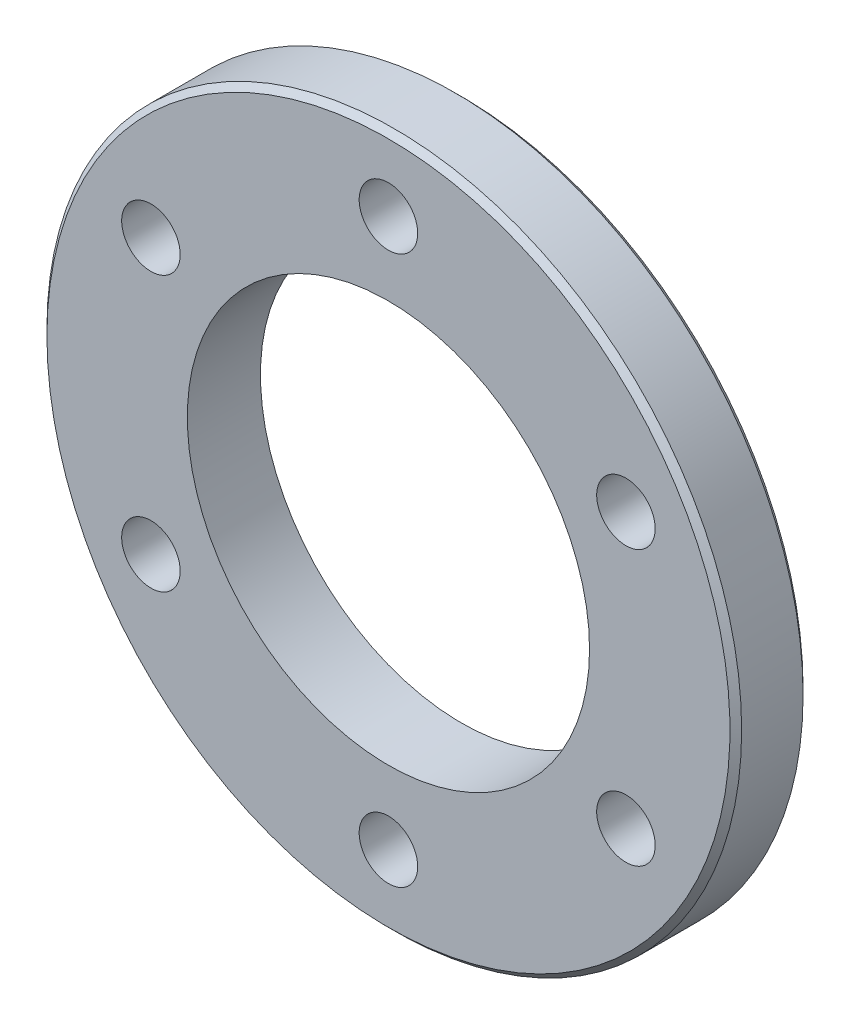
ISO-10303-21;
HEADER;
FILE_DESCRIPTION(('STEP AP214'),'2;1');
FILE_NAME('part.step','',(''),(''),'','','');
FILE_SCHEMA(('AUTOMOTIVE_DESIGN { 1 0 10303 214 1 1 1 1 }'));
ENDSEC;
DATA;
#1=APPLICATION_CONTEXT('core data for automotive mechanical design processes');
#2=APPLICATION_PROTOCOL_DEFINITION('international standard','automotive_design',2000,#1);
#3=PRODUCT_CONTEXT('',#1,'mechanical');
#4=PRODUCT('Part','Part','',(#3));
#5=PRODUCT_RELATED_PRODUCT_CATEGORY('part','',(#4));
#6=PRODUCT_DEFINITION_FORMATION('','',#4);
#7=PRODUCT_DEFINITION_CONTEXT('part definition',#1,'design');
#8=PRODUCT_DEFINITION('design','',#6,#7);
#9=PRODUCT_DEFINITION_SHAPE('','',#8);
#10=(LENGTH_UNIT() NAMED_UNIT(*) SI_UNIT(.MILLI.,.METRE.));
#11=(NAMED_UNIT(*) PLANE_ANGLE_UNIT() SI_UNIT($,.RADIAN.));
#12=(NAMED_UNIT(*) SI_UNIT($,.STERADIAN.) SOLID_ANGLE_UNIT());
#13=UNCERTAINTY_MEASURE_WITH_UNIT(LENGTH_MEASURE(1.E-05),#10,'distance_accuracy_value','');
#14=(GEOMETRIC_REPRESENTATION_CONTEXT(3) GLOBAL_UNCERTAINTY_ASSIGNED_CONTEXT((#13)) GLOBAL_UNIT_ASSIGNED_CONTEXT((#10,
#11,#12)) REPRESENTATION_CONTEXT('',''));
#15=CARTESIAN_POINT('',(0.,0.,0.));
#16=DIRECTION('',(0.,0.,1.));
#17=DIRECTION('',(1.,0.,0.));
#18=AXIS2_PLACEMENT_3D('',#15,#16,#17);
#19=CARTESIAN_POINT('',(0.,0.,5.84199999977205));
#20=DIRECTION('',(0.,0.,-1.));
#21=DIRECTION('',(-1.,0.,0.));
#22=AXIS2_PLACEMENT_3D('',#19,#20,#21);
#23=CONICAL_SURFACE('',#22,30.1624999997721,0.785398162500003);
#24=CARTESIAN_POINT('',(0.,0.,5.842));
#25=DIRECTION('',(0.,0.,1.));
#26=DIRECTION('',(1.,0.,0.));
#27=AXIS2_PLACEMENT_3D('',#24,#25,#26);
#28=CIRCLE('',#27,30.1625);
#29=CARTESIAN_POINT('',(30.1625,0.,5.842));
#30=VERTEX_POINT('',#29);
#31=EDGE_CURVE('E77',#30,#30,#28,.F.);
#32=ORIENTED_EDGE('',*,*,#31,.F.);
#33=EDGE_LOOP('',(#32));
#34=FACE_BOUND('',#33,.T.);
#35=CARTESIAN_POINT('',(0.,0.,6.35000000022795));
#36=DIRECTION('',(0.,0.,-1.));
#37=DIRECTION('',(-1.,0.,0.));
#38=AXIS2_PLACEMENT_3D('',#35,#36,#37);
#39=CIRCLE('',#38,29.654500000228);
#40=CARTESIAN_POINT('',(-29.654500000228,0.,6.35000000022795));
#41=VERTEX_POINT('',#40);
#42=EDGE_CURVE('E18',#41,#41,#39,.T.);
#43=ORIENTED_EDGE('',*,*,#42,.T.);
#44=EDGE_LOOP('',(#43));
#45=FACE_BOUND('',#44,.T.);
#46=ADVANCED_FACE('F15',(#34,#45),#23,.T.);
#47=CARTESIAN_POINT('',(0.,0.,0.));
#48=DIRECTION('',(0.,0.,1.));
#49=DIRECTION('',(1.,0.,0.));
#50=AXIS2_PLACEMENT_3D('',#47,#48,#49);
#51=CYLINDRICAL_SURFACE('',#50,30.1625);
#52=CARTESIAN_POINT('',(0.,0.,0.508000000227951));
#53=DIRECTION('',(0.,0.,1.));
#54=DIRECTION('',(-1.,0.,0.));
#55=AXIS2_PLACEMENT_3D('',#52,#53,#54);
#56=CIRCLE('',#55,30.1624999997721);
#57=CARTESIAN_POINT('',(-30.162499999772,0.,0.508000000227952));
#58=VERTEX_POINT('',#57);
#59=EDGE_CURVE('E69',#58,#58,#56,.F.);
#60=ORIENTED_EDGE('',*,*,#59,.F.);
#61=EDGE_LOOP('',(#60));
#62=FACE_BOUND('',#61,.T.);
#63=ORIENTED_EDGE('',*,*,#31,.T.);
#64=EDGE_LOOP('',(#63));
#65=FACE_BOUND('',#64,.T.);
#66=ADVANCED_FACE('F83',(#62,#65),#51,.T.);
#67=CARTESIAN_POINT('',(0.,0.,6.35));
#68=DIRECTION('',(0.,0.,-1.));
#69=DIRECTION('',(-1.,0.,0.));
#70=AXIS2_PLACEMENT_3D('',#67,#68,#69);
#71=PLANE('',#70);
#72=CARTESIAN_POINT('',(0.,0.,6.35));
#73=DIRECTION('',(0.,0.,1.));
#74=DIRECTION('',(1.,0.,0.));
#75=AXIS2_PLACEMENT_3D('',#72,#73,#74);
#76=CIRCLE('',#75,17.4625);
#77=CARTESIAN_POINT('',(17.4625,0.,6.35));
#78=VERTEX_POINT('',#77);
#79=EDGE_CURVE('E50',#78,#78,#76,.F.);
#80=ORIENTED_EDGE('',*,*,#79,.T.);
#81=EDGE_LOOP('',(#80));
#82=FACE_BOUND('',#81,.T.);
#83=CARTESIAN_POINT('',(20.622229927617,11.90625,6.35));
#84=DIRECTION('',(0.,0.,1.));
#85=DIRECTION('',(1.,0.,0.));
#86=AXIS2_PLACEMENT_3D('',#83,#84,#85);
#87=CIRCLE('',#86,2.54);
#88=CARTESIAN_POINT('',(23.162229927617,11.90625,6.35));
#89=VERTEX_POINT('',#88);
#90=EDGE_CURVE('E53',#89,#89,#87,.F.);
#91=ORIENTED_EDGE('',*,*,#90,.T.);
#92=EDGE_LOOP('',(#91));
#93=FACE_BOUND('',#92,.T.);
#94=CARTESIAN_POINT('',(20.6222299276169,-11.90625,6.35));
#95=DIRECTION('',(0.,0.,1.));
#96=DIRECTION('',(1.,0.,0.));
#97=AXIS2_PLACEMENT_3D('',#94,#95,#96);
#98=CIRCLE('',#97,2.54);
#99=CARTESIAN_POINT('',(23.1622299276169,-11.90625,6.35));
#100=VERTEX_POINT('',#99);
#101=EDGE_CURVE('E56',#100,#100,#98,.F.);
#102=ORIENTED_EDGE('',*,*,#101,.T.);
#103=EDGE_LOOP('',(#102));
#104=FACE_BOUND('',#103,.T.);
#105=CARTESIAN_POINT('',(0.,-23.8125,6.35));
#106=DIRECTION('',(0.,0.,1.));
#107=DIRECTION('',(1.,0.,0.));
#108=AXIS2_PLACEMENT_3D('',#105,#106,#107);
#109=CIRCLE('',#108,2.54);
#110=CARTESIAN_POINT('',(2.54,-23.8125,6.35));
#111=VERTEX_POINT('',#110);
#112=EDGE_CURVE('E59',#111,#111,#109,.F.);
#113=ORIENTED_EDGE('',*,*,#112,.T.);
#114=EDGE_LOOP('',(#113));
#115=FACE_BOUND('',#114,.T.);
#116=CARTESIAN_POINT('',(-20.6222299276169,-11.90625,6.35));
#117=DIRECTION('',(0.,0.,1.));
#118=DIRECTION('',(1.,0.,0.));
#119=AXIS2_PLACEMENT_3D('',#116,#117,#118);
#120=CIRCLE('',#119,2.54);
#121=CARTESIAN_POINT('',(-18.0822299276169,-11.90625,6.35));
#122=VERTEX_POINT('',#121);
#123=EDGE_CURVE('E62',#122,#122,#120,.F.);
#124=ORIENTED_EDGE('',*,*,#123,.T.);
#125=EDGE_LOOP('',(#124));
#126=FACE_BOUND('',#125,.T.);
#127=CARTESIAN_POINT('',(-20.6222299276169,11.90625,6.35));
#128=DIRECTION('',(0.,0.,1.));
#129=DIRECTION('',(1.,0.,0.));
#130=AXIS2_PLACEMENT_3D('',#127,#128,#129);
#131=CIRCLE('',#130,2.54);
#132=CARTESIAN_POINT('',(-18.0822299276169,11.90625,6.35));
#133=VERTEX_POINT('',#132);
#134=EDGE_CURVE('E65',#133,#133,#131,.F.);
#135=ORIENTED_EDGE('',*,*,#134,.T.);
#136=EDGE_LOOP('',(#135));
#137=FACE_BOUND('',#136,.T.);
#138=CARTESIAN_POINT('',(0.,23.8125,6.35));
#139=DIRECTION('',(0.,0.,1.));
#140=DIRECTION('',(1.,0.,0.));
#141=AXIS2_PLACEMENT_3D('',#138,#139,#140);
#142=CIRCLE('',#141,2.54);
#143=CARTESIAN_POINT('',(2.54,23.8125,6.35));
#144=VERTEX_POINT('',#143);
#145=EDGE_CURVE('E67',#144,#144,#142,.F.);
#146=ORIENTED_EDGE('',*,*,#145,.T.);
#147=EDGE_LOOP('',(#146));
#148=FACE_BOUND('',#147,.T.);
#149=ORIENTED_EDGE('',*,*,#42,.F.);
#150=EDGE_LOOP('',(#149));
#151=FACE_BOUND('',#150,.T.);
#152=ADVANCED_FACE('F89',(#82,#93,#104,#115,#126,#137,#148,#151),#71,.F.);
#153=CARTESIAN_POINT('',(0.,0.,0.508000000227954));
#154=DIRECTION('',(0.,0.,1.));
#155=DIRECTION('',(1.,0.,0.));
#156=AXIS2_PLACEMENT_3D('',#153,#154,#155);
#157=CONICAL_SURFACE('',#156,30.1624999997721,0.785398162500002);
#158=CARTESIAN_POINT('',(0.,0.,-2.27951121520298E-10));
#159=DIRECTION('',(0.,0.,1.));
#160=DIRECTION('',(1.,0.,0.));
#161=AXIS2_PLACEMENT_3D('',#158,#159,#160);
#162=CIRCLE('',#161,29.654500000228);
#163=CARTESIAN_POINT('',(29.654500000228,0.,-2.27951121520298E-10));
#164=VERTEX_POINT('',#163);
#165=EDGE_CURVE('E47',#164,#164,#162,.F.);
#166=ORIENTED_EDGE('',*,*,#165,.F.);
#167=EDGE_LOOP('',(#166));
#168=FACE_BOUND('',#167,.T.);
#169=ORIENTED_EDGE('',*,*,#59,.T.);
#170=EDGE_LOOP('',(#169));
#171=FACE_BOUND('',#170,.T.);
#172=ADVANCED_FACE('F91',(#168,#171),#157,.T.);
#173=CARTESIAN_POINT('',(0.,23.8125,0.));
#174=DIRECTION('',(0.,0.,1.));
#175=DIRECTION('',(1.,0.,0.));
#176=AXIS2_PLACEMENT_3D('',#173,#174,#175);
#177=CYLINDRICAL_SURFACE('',#176,2.54);
#178=CARTESIAN_POINT('',(0.,23.8125,0.));
#179=DIRECTION('',(0.,0.,1.));
#180=DIRECTION('',(1.,0.,0.));
#181=AXIS2_PLACEMENT_3D('',#178,#179,#180);
#182=CIRCLE('',#181,2.54);
#183=CARTESIAN_POINT('',(2.54,23.8125,0.));
#184=VERTEX_POINT('',#183);
#185=EDGE_CURVE('E44',#184,#184,#182,.T.);
#186=ORIENTED_EDGE('',*,*,#185,.F.);
#187=EDGE_LOOP('',(#186));
#188=FACE_BOUND('',#187,.T.);
#189=ORIENTED_EDGE('',*,*,#145,.F.);
#190=EDGE_LOOP('',(#189));
#191=FACE_BOUND('',#190,.T.);
#192=ADVANCED_FACE('F99',(#188,#191),#177,.F.);
#193=CARTESIAN_POINT('',(-20.6222299276169,11.90625,0.));
#194=DIRECTION('',(0.,0.,1.));
#195=DIRECTION('',(1.,0.,0.));
#196=AXIS2_PLACEMENT_3D('',#193,#194,#195);
#197=CYLINDRICAL_SURFACE('',#196,2.54);
#198=CARTESIAN_POINT('',(-20.6222299276169,11.90625,0.));
#199=DIRECTION('',(0.,0.,1.));
#200=DIRECTION('',(1.,0.,0.));
#201=AXIS2_PLACEMENT_3D('',#198,#199,#200);
#202=CIRCLE('',#201,2.54);
#203=CARTESIAN_POINT('',(-18.0822299276169,11.90625,0.));
#204=VERTEX_POINT('',#203);
#205=EDGE_CURVE('E41',#204,#204,#202,.T.);
#206=ORIENTED_EDGE('',*,*,#205,.F.);
#207=EDGE_LOOP('',(#206));
#208=FACE_BOUND('',#207,.T.);
#209=ORIENTED_EDGE('',*,*,#134,.F.);
#210=EDGE_LOOP('',(#209));
#211=FACE_BOUND('',#210,.T.);
#212=ADVANCED_FACE('F130',(#208,#211),#197,.F.);
#213=CARTESIAN_POINT('',(-20.6222299276169,-11.90625,0.));
#214=DIRECTION('',(0.,0.,1.));
#215=DIRECTION('',(1.,0.,0.));
#216=AXIS2_PLACEMENT_3D('',#213,#214,#215);
#217=CYLINDRICAL_SURFACE('',#216,2.54);
#218=CARTESIAN_POINT('',(-20.6222299276169,-11.90625,0.));
#219=DIRECTION('',(0.,0.,1.));
#220=DIRECTION('',(1.,0.,0.));
#221=AXIS2_PLACEMENT_3D('',#218,#219,#220);
#222=CIRCLE('',#221,2.54);
#223=CARTESIAN_POINT('',(-18.0822299276169,-11.90625,0.));
#224=VERTEX_POINT('',#223);
#225=EDGE_CURVE('E38',#224,#224,#222,.T.);
#226=ORIENTED_EDGE('',*,*,#225,.F.);
#227=EDGE_LOOP('',(#226));
#228=FACE_BOUND('',#227,.T.);
#229=ORIENTED_EDGE('',*,*,#123,.F.);
#230=EDGE_LOOP('',(#229));
#231=FACE_BOUND('',#230,.T.);
#232=ADVANCED_FACE('F126',(#228,#231),#217,.F.);
#233=CARTESIAN_POINT('',(0.,-23.8125,0.));
#234=DIRECTION('',(0.,0.,1.));
#235=DIRECTION('',(1.,0.,0.));
#236=AXIS2_PLACEMENT_3D('',#233,#234,#235);
#237=CYLINDRICAL_SURFACE('',#236,2.54);
#238=CARTESIAN_POINT('',(0.,-23.8125,0.));
#239=DIRECTION('',(0.,0.,1.));
#240=DIRECTION('',(1.,0.,0.));
#241=AXIS2_PLACEMENT_3D('',#238,#239,#240);
#242=CIRCLE('',#241,2.54);
#243=CARTESIAN_POINT('',(2.54,-23.8125,0.));
#244=VERTEX_POINT('',#243);
#245=EDGE_CURVE('E35',#244,#244,#242,.T.);
#246=ORIENTED_EDGE('',*,*,#245,.F.);
#247=EDGE_LOOP('',(#246));
#248=FACE_BOUND('',#247,.T.);
#249=ORIENTED_EDGE('',*,*,#112,.F.);
#250=EDGE_LOOP('',(#249));
#251=FACE_BOUND('',#250,.T.);
#252=ADVANCED_FACE('F122',(#248,#251),#237,.F.);
#253=CARTESIAN_POINT('',(20.6222299276169,-11.90625,0.));
#254=DIRECTION('',(0.,0.,1.));
#255=DIRECTION('',(1.,0.,0.));
#256=AXIS2_PLACEMENT_3D('',#253,#254,#255);
#257=CYLINDRICAL_SURFACE('',#256,2.54);
#258=CARTESIAN_POINT('',(20.6222299276169,-11.90625,0.));
#259=DIRECTION('',(0.,0.,1.));
#260=DIRECTION('',(1.,0.,0.));
#261=AXIS2_PLACEMENT_3D('',#258,#259,#260);
#262=CIRCLE('',#261,2.54);
#263=CARTESIAN_POINT('',(23.1622299276169,-11.90625,0.));
#264=VERTEX_POINT('',#263);
#265=EDGE_CURVE('E27',#264,#264,#262,.T.);
#266=ORIENTED_EDGE('',*,*,#265,.F.);
#267=EDGE_LOOP('',(#266));
#268=FACE_BOUND('',#267,.T.);
#269=ORIENTED_EDGE('',*,*,#101,.F.);
#270=EDGE_LOOP('',(#269));
#271=FACE_BOUND('',#270,.T.);
#272=ADVANCED_FACE('F118',(#268,#271),#257,.F.);
#273=CARTESIAN_POINT('',(20.622229927617,11.90625,0.));
#274=DIRECTION('',(0.,0.,1.));
#275=DIRECTION('',(1.,0.,0.));
#276=AXIS2_PLACEMENT_3D('',#273,#274,#275);
#277=CYLINDRICAL_SURFACE('',#276,2.54);
#278=CARTESIAN_POINT('',(20.622229927617,11.90625,0.));
#279=DIRECTION('',(0.,0.,1.));
#280=DIRECTION('',(1.,0.,0.));
#281=AXIS2_PLACEMENT_3D('',#278,#279,#280);
#282=CIRCLE('',#281,2.54);
#283=CARTESIAN_POINT('',(23.162229927617,11.90625,0.));
#284=VERTEX_POINT('',#283);
#285=EDGE_CURVE('E22',#284,#284,#282,.T.);
#286=ORIENTED_EDGE('',*,*,#285,.F.);
#287=EDGE_LOOP('',(#286));
#288=FACE_BOUND('',#287,.T.);
#289=ORIENTED_EDGE('',*,*,#90,.F.);
#290=EDGE_LOOP('',(#289));
#291=FACE_BOUND('',#290,.T.);
#292=ADVANCED_FACE('F111',(#288,#291),#277,.F.);
#293=CARTESIAN_POINT('',(0.,0.,0.));
#294=DIRECTION('',(0.,0.,1.));
#295=DIRECTION('',(1.,0.,0.));
#296=AXIS2_PLACEMENT_3D('',#293,#294,#295);
#297=CYLINDRICAL_SURFACE('',#296,17.4625);
#298=CARTESIAN_POINT('',(0.,0.,0.));
#299=DIRECTION('',(0.,0.,1.));
#300=DIRECTION('',(1.,0.,0.));
#301=AXIS2_PLACEMENT_3D('',#298,#299,#300);
#302=CIRCLE('',#301,17.4625);
#303=CARTESIAN_POINT('',(17.4625,0.,0.));
#304=VERTEX_POINT('',#303);
#305=EDGE_CURVE('E10',#304,#304,#302,.T.);
#306=ORIENTED_EDGE('',*,*,#305,.F.);
#307=EDGE_LOOP('',(#306));
#308=FACE_BOUND('',#307,.T.);
#309=ORIENTED_EDGE('',*,*,#79,.F.);
#310=EDGE_LOOP('',(#309));
#311=FACE_BOUND('',#310,.T.);
#312=ADVANCED_FACE('F106',(#308,#311),#297,.F.);
#313=CARTESIAN_POINT('',(0.,0.,0.));
#314=DIRECTION('',(0.,0.,-1.));
#315=DIRECTION('',(-1.,0.,0.));
#316=AXIS2_PLACEMENT_3D('',#313,#314,#315);
#317=PLANE('',#316);
#318=ORIENTED_EDGE('',*,*,#305,.T.);
#319=EDGE_LOOP('',(#318));
#320=FACE_BOUND('',#319,.T.);
#321=ORIENTED_EDGE('',*,*,#285,.T.);
#322=EDGE_LOOP('',(#321));
#323=FACE_BOUND('',#322,.T.);
#324=ORIENTED_EDGE('',*,*,#265,.T.);
#325=EDGE_LOOP('',(#324));
#326=FACE_BOUND('',#325,.T.);
#327=ORIENTED_EDGE('',*,*,#245,.T.);
#328=EDGE_LOOP('',(#327));
#329=FACE_BOUND('',#328,.T.);
#330=ORIENTED_EDGE('',*,*,#225,.T.);
#331=EDGE_LOOP('',(#330));
#332=FACE_BOUND('',#331,.T.);
#333=ORIENTED_EDGE('',*,*,#205,.T.);
#334=EDGE_LOOP('',(#333));
#335=FACE_BOUND('',#334,.T.);
#336=ORIENTED_EDGE('',*,*,#185,.T.);
#337=EDGE_LOOP('',(#336));
#338=FACE_BOUND('',#337,.T.);
#339=ORIENTED_EDGE('',*,*,#165,.T.);
#340=EDGE_LOOP('',(#339));
#341=FACE_BOUND('',#340,.T.);
#342=ADVANCED_FACE('F104',(#320,#323,#326,#329,#332,#335,#338,#341),#317,.T.);
#343=CLOSED_SHELL('',(#46,#66,#152,#172,#192,#212,#232,#252,#272,#292,#312,#342));
#344=MANIFOLD_SOLID_BREP('B1',#343);
#345=ADVANCED_BREP_SHAPE_REPRESENTATION('',(#18,#344),#14);
#346=SHAPE_DEFINITION_REPRESENTATION(#9,#345);
ENDSEC;
END-ISO-10303-21;
